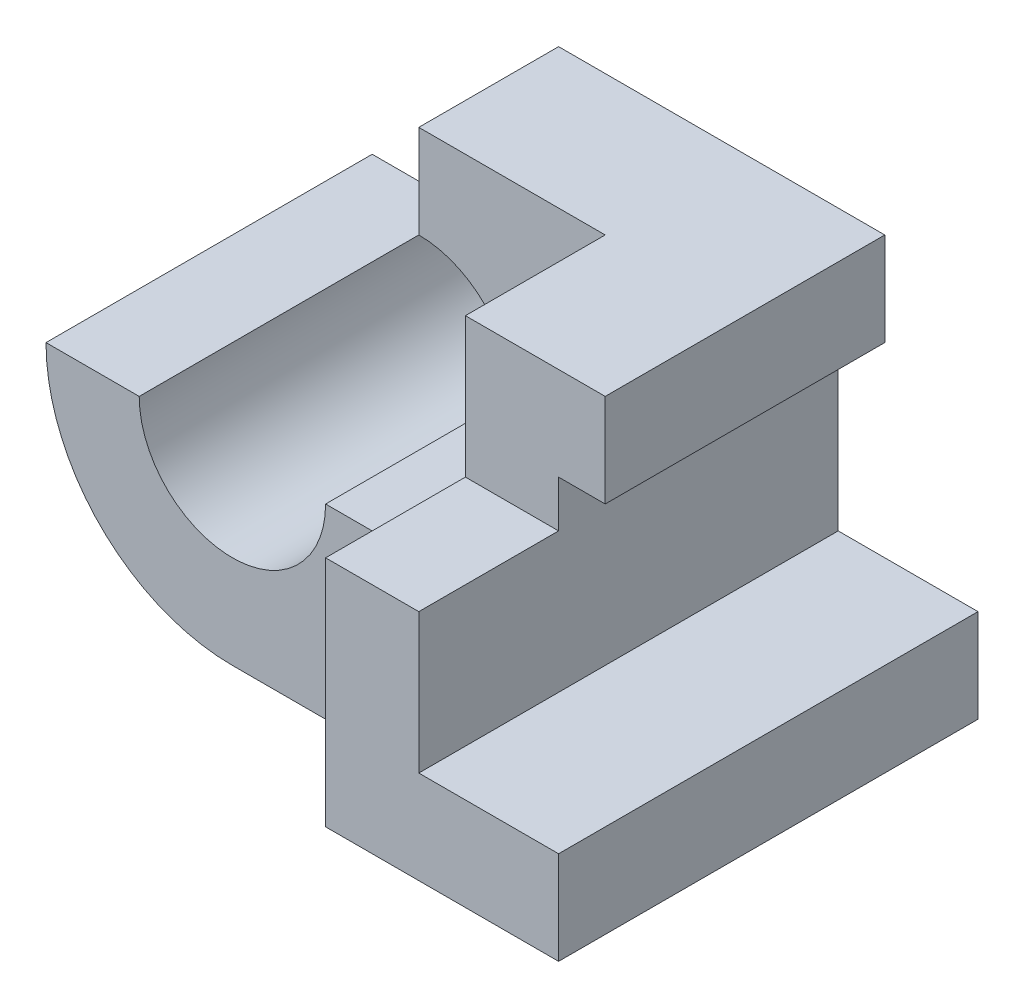
ISO-10303-21;
HEADER;
FILE_DESCRIPTION(('STEP AP214'),'2;1');
FILE_NAME('part.step','',(''),(''),'','','');
FILE_SCHEMA(('AUTOMOTIVE_DESIGN { 1 0 10303 214 1 1 1 1 }'));
ENDSEC;
DATA;
#1=APPLICATION_CONTEXT('core data for automotive mechanical design processes');
#2=APPLICATION_PROTOCOL_DEFINITION('international standard','automotive_design',2000,#1);
#3=PRODUCT_CONTEXT('',#1,'mechanical');
#4=PRODUCT('Part','Part','',(#3));
#5=PRODUCT_RELATED_PRODUCT_CATEGORY('part','',(#4));
#6=PRODUCT_DEFINITION_FORMATION('','',#4);
#7=PRODUCT_DEFINITION_CONTEXT('part definition',#1,'design');
#8=PRODUCT_DEFINITION('design','',#6,#7);
#9=PRODUCT_DEFINITION_SHAPE('','',#8);
#10=(LENGTH_UNIT() NAMED_UNIT(*) SI_UNIT(.MILLI.,.METRE.));
#11=(NAMED_UNIT(*) PLANE_ANGLE_UNIT() SI_UNIT($,.RADIAN.));
#12=(NAMED_UNIT(*) SI_UNIT($,.STERADIAN.) SOLID_ANGLE_UNIT());
#13=UNCERTAINTY_MEASURE_WITH_UNIT(LENGTH_MEASURE(1.E-05),#10,'distance_accuracy_value','');
#14=(GEOMETRIC_REPRESENTATION_CONTEXT(3) GLOBAL_UNCERTAINTY_ASSIGNED_CONTEXT((#13)) GLOBAL_UNIT_ASSIGNED_CONTEXT((#10,
#11,#12)) REPRESENTATION_CONTEXT('',''));
#15=CARTESIAN_POINT('',(0.,0.,0.));
#16=DIRECTION('',(0.,0.,1.));
#17=DIRECTION('',(1.,0.,0.));
#18=AXIS2_PLACEMENT_3D('',#15,#16,#17);
#19=CARTESIAN_POINT('',(0.,0.,0.));
#20=DIRECTION('',(0.,0.,1.));
#21=DIRECTION('',(1.,0.,0.));
#22=AXIS2_PLACEMENT_3D('',#19,#20,#21);
#23=PLANE('',#22);
#24=DIRECTION('',(1.,0.,0.));
#25=VECTOR('',#24,1.);
#26=CARTESIAN_POINT('',(0.,40.,0.));
#27=LINE('',#26,#25);
#28=CARTESIAN_POINT('',(0.,40.,0.));
#29=VERTEX_POINT('',#28);
#30=CARTESIAN_POINT('',(70.,40.,0.));
#31=VERTEX_POINT('',#30);
#32=EDGE_CURVE('E175',#29,#31,#27,.T.);
#33=ORIENTED_EDGE('',*,*,#32,.T.);
#34=DIRECTION('',(0.,-1.,0.));
#35=VECTOR('',#34,1.);
#36=CARTESIAN_POINT('',(70.,40.,0.));
#37=LINE('',#36,#35);
#38=CARTESIAN_POINT('',(70.,20.,0.));
#39=VERTEX_POINT('',#38);
#40=EDGE_CURVE('E159',#31,#39,#37,.T.);
#41=ORIENTED_EDGE('',*,*,#40,.T.);
#42=DIRECTION('',(-1.,0.,0.));
#43=VECTOR('',#42,1.);
#44=CARTESIAN_POINT('',(70.,20.,0.));
#45=LINE('',#44,#43);
#46=CARTESIAN_POINT('',(60.,20.,0.));
#47=VERTEX_POINT('',#46);
#48=EDGE_CURVE('E168',#39,#47,#45,.T.);
#49=ORIENTED_EDGE('',*,*,#48,.T.);
#50=DIRECTION('',(0.,1.,0.));
#51=VECTOR('',#50,1.);
#52=CARTESIAN_POINT('',(60.,10.,0.));
#53=LINE('',#52,#51);
#54=CARTESIAN_POINT('',(60.,-20.,0.));
#55=VERTEX_POINT('',#54);
#56=EDGE_CURVE('E50',#55,#47,#53,.T.);
#57=ORIENTED_EDGE('',*,*,#56,.F.);
#58=DIRECTION('',(1.,0.,0.));
#59=VECTOR('',#58,1.);
#60=CARTESIAN_POINT('',(70.,-20.,0.));
#61=LINE('',#60,#59);
#62=CARTESIAN_POINT('',(90.,-20.,0.));
#63=VERTEX_POINT('',#62);
#64=EDGE_CURVE('E58',#55,#63,#61,.T.);
#65=ORIENTED_EDGE('',*,*,#64,.T.);
#66=DIRECTION('',(0.,1.,0.));
#67=VECTOR('',#66,1.);
#68=CARTESIAN_POINT('',(90.,-20.,0.));
#69=LINE('',#68,#67);
#70=CARTESIAN_POINT('',(90.,-40.,0.));
#71=VERTEX_POINT('',#70);
#72=EDGE_CURVE('E188',#71,#63,#69,.T.);
#73=ORIENTED_EDGE('',*,*,#72,.F.);
#74=DIRECTION('',(-1.,0.,0.));
#75=VECTOR('',#74,1.);
#76=CARTESIAN_POINT('',(0.,-40.,0.));
#77=LINE('',#76,#75);
#78=CARTESIAN_POINT('',(-1.34760665507113E-13,-40.,0.));
#79=VERTEX_POINT('',#78);
#80=EDGE_CURVE('E271',#71,#79,#77,.T.);
#81=ORIENTED_EDGE('',*,*,#80,.T.);
#82=CARTESIAN_POINT('',(0.,0.,0.));
#83=DIRECTION('',(0.,0.,1.));
#84=DIRECTION('',(1.,0.,0.));
#85=AXIS2_PLACEMENT_3D('',#82,#83,#84);
#86=CIRCLE('',#85,40.);
#87=CARTESIAN_POINT('',(-40.,0.,0.));
#88=VERTEX_POINT('',#87);
#89=EDGE_CURVE('E263',#79,#88,#86,.F.);
#90=ORIENTED_EDGE('',*,*,#89,.T.);
#91=DIRECTION('',(1.,0.,0.));
#92=VECTOR('',#91,1.);
#93=CARTESIAN_POINT('',(0.,0.,0.));
#94=LINE('',#93,#92);
#95=CARTESIAN_POINT('',(-20.,0.,0.));
#96=VERTEX_POINT('',#95);
#97=EDGE_CURVE('E268',#88,#96,#94,.T.);
#98=ORIENTED_EDGE('',*,*,#97,.T.);
#99=CARTESIAN_POINT('',(0.,0.,0.));
#100=DIRECTION('',(0.,0.,1.));
#101=DIRECTION('',(1.,0.,0.));
#102=AXIS2_PLACEMENT_3D('',#99,#100,#101);
#103=CIRCLE('',#102,20.);
#104=CARTESIAN_POINT('',(0.,20.,0.));
#105=VERTEX_POINT('',#104);
#106=EDGE_CURVE('E278',#96,#105,#103,.T.);
#107=ORIENTED_EDGE('',*,*,#106,.T.);
#108=DIRECTION('',(0.,-1.,0.));
#109=VECTOR('',#108,1.);
#110=CARTESIAN_POINT('',(0.,0.,0.));
#111=LINE('',#110,#109);
#112=EDGE_CURVE('E275',#29,#105,#111,.T.);
#113=ORIENTED_EDGE('',*,*,#112,.F.);
#114=EDGE_LOOP('',(#33,#41,#49,#57,#65,#73,#81,#90,#98,#107,#113));
#115=FACE_BOUND('',#114,.T.);
#116=ADVANCED_FACE('F35',(#115),#23,.F.);
#117=CARTESIAN_POINT('',(70.,-20.,0.));
#118=DIRECTION('',(0.,-1.,0.));
#119=DIRECTION('',(1.,0.,0.));
#120=AXIS2_PLACEMENT_3D('',#117,#118,#119);
#121=PLANE('',#120);
#122=ORIENTED_EDGE('',*,*,#64,.F.);
#123=DIRECTION('',(0.,0.,-1.));
#124=VECTOR('',#123,1.);
#125=CARTESIAN_POINT('',(60.,-20.,90.));
#126=LINE('',#125,#124);
#127=CARTESIAN_POINT('',(60.,-20.,90.));
#128=VERTEX_POINT('',#127);
#129=EDGE_CURVE('E197',#128,#55,#126,.T.);
#130=ORIENTED_EDGE('',*,*,#129,.F.);
#131=DIRECTION('',(-1.,0.,0.));
#132=VECTOR('',#131,1.);
#133=CARTESIAN_POINT('',(50.,-20.,90.));
#134=LINE('',#133,#132);
#135=CARTESIAN_POINT('',(90.,-20.,90.));
#136=VERTEX_POINT('',#135);
#137=EDGE_CURVE('E206',#136,#128,#134,.T.);
#138=ORIENTED_EDGE('',*,*,#137,.F.);
#139=DIRECTION('',(0.,0.,1.));
#140=VECTOR('',#139,1.);
#141=CARTESIAN_POINT('',(90.,-20.,90.));
#142=LINE('',#141,#140);
#143=EDGE_CURVE('E191',#63,#136,#142,.T.);
#144=ORIENTED_EDGE('',*,*,#143,.F.);
#145=EDGE_LOOP('',(#122,#130,#138,#144));
#146=FACE_BOUND('',#145,.T.);
#147=ADVANCED_FACE('F302',(#146),#121,.F.);
#148=CARTESIAN_POINT('',(0.,40.,90.));
#149=DIRECTION('',(0.,1.,0.));
#150=DIRECTION('',(0.,0.,1.));
#151=AXIS2_PLACEMENT_3D('',#148,#149,#150);
#152=PLANE('',#151);
#153=DIRECTION('',(0.,0.,-1.));
#154=VECTOR('',#153,1.);
#155=CARTESIAN_POINT('',(70.,40.,0.));
#156=LINE('',#155,#154);
#157=CARTESIAN_POINT('',(70.,40.,60.));
#158=VERTEX_POINT('',#157);
#159=EDGE_CURVE('E203',#158,#31,#156,.T.);
#160=ORIENTED_EDGE('',*,*,#159,.T.);
#161=ORIENTED_EDGE('',*,*,#32,.F.);
#162=DIRECTION('',(0.,0.,-1.));
#163=VECTOR('',#162,1.);
#164=CARTESIAN_POINT('',(0.,40.,90.));
#165=LINE('',#164,#163);
#166=CARTESIAN_POINT('',(0.,40.,30.));
#167=VERTEX_POINT('',#166);
#168=EDGE_CURVE('E288',#167,#29,#165,.T.);
#169=ORIENTED_EDGE('',*,*,#168,.F.);
#170=DIRECTION('',(-1.,0.,0.));
#171=VECTOR('',#170,1.);
#172=CARTESIAN_POINT('',(0.,40.,30.));
#173=LINE('',#172,#171);
#174=CARTESIAN_POINT('',(40.,40.,30.));
#175=VERTEX_POINT('',#174);
#176=EDGE_CURVE('E228',#175,#167,#173,.T.);
#177=ORIENTED_EDGE('',*,*,#176,.F.);
#178=DIRECTION('',(0.,0.,1.));
#179=VECTOR('',#178,1.);
#180=CARTESIAN_POINT('',(40.,40.,30.));
#181=LINE('',#180,#179);
#182=CARTESIAN_POINT('',(40.,40.,60.));
#183=VERTEX_POINT('',#182);
#184=EDGE_CURVE('E235',#175,#183,#181,.T.);
#185=ORIENTED_EDGE('',*,*,#184,.T.);
#186=DIRECTION('',(1.,0.,0.));
#187=VECTOR('',#186,1.);
#188=CARTESIAN_POINT('',(30.,40.,60.));
#189=LINE('',#188,#187);
#190=EDGE_CURVE('E210',#183,#158,#189,.T.);
#191=ORIENTED_EDGE('',*,*,#190,.T.);
#192=EDGE_LOOP('',(#160,#161,#169,#177,#185,#191));
#193=FACE_BOUND('',#192,.T.);
#194=ADVANCED_FACE('F336',(#193),#152,.T.);
#195=CARTESIAN_POINT('',(0.,0.,90.));
#196=DIRECTION('',(0.,0.,-1.));
#197=DIRECTION('',(-1.,0.,0.));
#198=AXIS2_PLACEMENT_3D('',#195,#196,#197);
#199=CYLINDRICAL_SURFACE('',#198,40.);
#200=DIRECTION('',(0.,0.,-1.));
#201=VECTOR('',#200,1.);
#202=CARTESIAN_POINT('',(-1.34760665507113E-13,-40.,90.));
#203=LINE('',#202,#201);
#204=CARTESIAN_POINT('',(-1.31838984174237E-13,-40.,70.));
#205=VERTEX_POINT('',#204);
#206=EDGE_CURVE('E43',#205,#79,#203,.T.);
#207=ORIENTED_EDGE('',*,*,#206,.F.);
#208=CARTESIAN_POINT('',(0.,0.,70.));
#209=DIRECTION('',(0.,0.,1.));
#210=DIRECTION('',(1.,0.,0.));
#211=AXIS2_PLACEMENT_3D('',#208,#209,#210);
#212=CIRCLE('',#211,40.);
#213=CARTESIAN_POINT('',(-40.,0.,70.));
#214=VERTEX_POINT('',#213);
#215=EDGE_CURVE('E259',#205,#214,#212,.F.);
#216=ORIENTED_EDGE('',*,*,#215,.T.);
#217=DIRECTION('',(0.,0.,-1.));
#218=VECTOR('',#217,1.);
#219=CARTESIAN_POINT('',(-40.,0.,90.));
#220=LINE('',#219,#218);
#221=EDGE_CURVE('E267',#214,#88,#220,.T.);
#222=ORIENTED_EDGE('',*,*,#221,.T.);
#223=ORIENTED_EDGE('',*,*,#89,.F.);
#224=EDGE_LOOP('',(#207,#216,#222,#223));
#225=FACE_BOUND('',#224,.T.);
#226=ADVANCED_FACE('F37',(#225),#199,.T.);
#227=CARTESIAN_POINT('',(0.,-40.,90.));
#228=DIRECTION('',(0.,-1.,0.));
#229=DIRECTION('',(0.,0.,-1.));
#230=AXIS2_PLACEMENT_3D('',#227,#228,#229);
#231=PLANE('',#230);
#232=DIRECTION('',(-1.,0.,0.));
#233=VECTOR('',#232,1.);
#234=CARTESIAN_POINT('',(0.,-40.,90.));
#235=LINE('',#234,#233);
#236=CARTESIAN_POINT('',(90.,-40.,90.));
#237=VERTEX_POINT('',#236);
#238=CARTESIAN_POINT('',(40.,-40.,90.));
#239=VERTEX_POINT('',#238);
#240=EDGE_CURVE('E264',#237,#239,#235,.T.);
#241=ORIENTED_EDGE('',*,*,#240,.T.);
#242=DIRECTION('',(0.,0.,-1.));
#243=VECTOR('',#242,1.);
#244=CARTESIAN_POINT('',(40.,-40.,90.));
#245=LINE('',#244,#243);
#246=CARTESIAN_POINT('',(40.,-40.,70.));
#247=VERTEX_POINT('',#246);
#248=EDGE_CURVE('E238',#239,#247,#245,.T.);
#249=ORIENTED_EDGE('',*,*,#248,.T.);
#250=DIRECTION('',(-1.,0.,0.));
#251=VECTOR('',#250,1.);
#252=CARTESIAN_POINT('',(-40.,-40.,70.));
#253=LINE('',#252,#251);
#254=EDGE_CURVE('E245',#247,#205,#253,.T.);
#255=ORIENTED_EDGE('',*,*,#254,.T.);
#256=ORIENTED_EDGE('',*,*,#206,.T.);
#257=ORIENTED_EDGE('',*,*,#80,.F.);
#258=DIRECTION('',(0.,0.,-1.));
#259=VECTOR('',#258,1.);
#260=CARTESIAN_POINT('',(90.,-40.,90.));
#261=LINE('',#260,#259);
#262=EDGE_CURVE('E185',#237,#71,#261,.T.);
#263=ORIENTED_EDGE('',*,*,#262,.F.);
#264=EDGE_LOOP('',(#241,#249,#255,#256,#257,#263));
#265=FACE_BOUND('',#264,.T.);
#266=ADVANCED_FACE('F292',(#265),#231,.T.);
#267=CARTESIAN_POINT('',(0.,0.,90.));
#268=DIRECTION('',(1.,0.,0.));
#269=DIRECTION('',(0.,1.,0.));
#270=AXIS2_PLACEMENT_3D('',#267,#268,#269);
#271=PLANE('',#270);
#272=DIRECTION('',(0.,0.,-1.));
#273=VECTOR('',#272,1.);
#274=CARTESIAN_POINT('',(0.,20.,90.));
#275=LINE('',#274,#273);
#276=CARTESIAN_POINT('',(0.,20.,30.));
#277=VERTEX_POINT('',#276);
#278=EDGE_CURVE('E286',#277,#105,#275,.T.);
#279=ORIENTED_EDGE('',*,*,#278,.F.);
#280=DIRECTION('',(0.,-1.,0.));
#281=VECTOR('',#280,1.);
#282=CARTESIAN_POINT('',(0.,20.,30.));
#283=LINE('',#282,#281);
#284=EDGE_CURVE('E230',#167,#277,#283,.T.);
#285=ORIENTED_EDGE('',*,*,#284,.F.);
#286=ORIENTED_EDGE('',*,*,#168,.T.);
#287=ORIENTED_EDGE('',*,*,#112,.T.);
#288=EDGE_LOOP('',(#279,#285,#286,#287));
#289=FACE_BOUND('',#288,.T.);
#290=ADVANCED_FACE('F332',(#289),#271,.F.);
#291=CARTESIAN_POINT('',(0.,0.,90.));
#292=DIRECTION('',(0.,0.,-1.));
#293=DIRECTION('',(-1.,0.,0.));
#294=AXIS2_PLACEMENT_3D('',#291,#292,#293);
#295=CYLINDRICAL_SURFACE('',#294,20.);
#296=DIRECTION('',(0.,0.,1.));
#297=VECTOR('',#296,1.);
#298=CARTESIAN_POINT('',(20.,0.,30.));
#299=LINE('',#298,#297);
#300=CARTESIAN_POINT('',(20.,0.,30.));
#301=VERTEX_POINT('',#300);
#302=CARTESIAN_POINT('',(20.,0.,70.));
#303=VERTEX_POINT('',#302);
#304=EDGE_CURVE('E232',#301,#303,#299,.T.);
#305=ORIENTED_EDGE('',*,*,#304,.F.);
#306=CARTESIAN_POINT('',(0.,0.,30.));
#307=DIRECTION('',(0.,0.,-1.));
#308=DIRECTION('',(-1.,0.,0.));
#309=AXIS2_PLACEMENT_3D('',#306,#307,#308);
#310=CIRCLE('',#309,20.);
#311=EDGE_CURVE('E220',#277,#301,#310,.T.);
#312=ORIENTED_EDGE('',*,*,#311,.F.);
#313=ORIENTED_EDGE('',*,*,#278,.T.);
#314=ORIENTED_EDGE('',*,*,#106,.F.);
#315=DIRECTION('',(0.,0.,-1.));
#316=VECTOR('',#315,1.);
#317=CARTESIAN_POINT('',(-20.,0.,90.));
#318=LINE('',#317,#316);
#319=CARTESIAN_POINT('',(-20.,0.,70.));
#320=VERTEX_POINT('',#319);
#321=EDGE_CURVE('E284',#320,#96,#318,.T.);
#322=ORIENTED_EDGE('',*,*,#321,.F.);
#323=CARTESIAN_POINT('',(0.,0.,70.));
#324=DIRECTION('',(0.,0.,1.));
#325=DIRECTION('',(1.,0.,0.));
#326=AXIS2_PLACEMENT_3D('',#323,#324,#325);
#327=CIRCLE('',#326,20.);
#328=EDGE_CURVE('E256',#320,#303,#327,.T.);
#329=ORIENTED_EDGE('',*,*,#328,.T.);
#330=EDGE_LOOP('',(#305,#312,#313,#314,#322,#329));
#331=FACE_BOUND('',#330,.T.);
#332=ADVANCED_FACE('F327',(#331),#295,.F.);
#333=CARTESIAN_POINT('',(0.,0.,90.));
#334=DIRECTION('',(0.,1.,0.));
#335=DIRECTION('',(0.,0.,1.));
#336=AXIS2_PLACEMENT_3D('',#333,#334,#335);
#337=PLANE('',#336);
#338=ORIENTED_EDGE('',*,*,#221,.F.);
#339=DIRECTION('',(1.,0.,0.));
#340=VECTOR('',#339,1.);
#341=CARTESIAN_POINT('',(0.,0.,70.));
#342=LINE('',#341,#340);
#343=EDGE_CURVE('E253',#214,#320,#342,.T.);
#344=ORIENTED_EDGE('',*,*,#343,.T.);
#345=ORIENTED_EDGE('',*,*,#321,.T.);
#346=ORIENTED_EDGE('',*,*,#97,.F.);
#347=EDGE_LOOP('',(#338,#344,#345,#346));
#348=FACE_BOUND('',#347,.T.);
#349=ADVANCED_FACE('F322',(#348),#337,.T.);
#350=CARTESIAN_POINT('',(0.,0.,90.));
#351=DIRECTION('',(0.,0.,1.));
#352=DIRECTION('',(1.,0.,0.));
#353=AXIS2_PLACEMENT_3D('',#350,#351,#352);
#354=PLANE('',#353);
#355=ORIENTED_EDGE('',*,*,#137,.T.);
#356=DIRECTION('',(0.,-1.,0.));
#357=VECTOR('',#356,1.);
#358=CARTESIAN_POINT('',(60.,10.,90.));
#359=LINE('',#358,#357);
#360=CARTESIAN_POINT('',(60.,10.,90.));
#361=VERTEX_POINT('',#360);
#362=EDGE_CURVE('E194',#361,#128,#359,.T.);
#363=ORIENTED_EDGE('',*,*,#362,.F.);
#364=DIRECTION('',(1.,0.,0.));
#365=VECTOR('',#364,1.);
#366=CARTESIAN_POINT('',(40.,10.,90.));
#367=LINE('',#366,#365);
#368=CARTESIAN_POINT('',(40.,10.,90.));
#369=VERTEX_POINT('',#368);
#370=EDGE_CURVE('E217',#369,#361,#367,.T.);
#371=ORIENTED_EDGE('',*,*,#370,.F.);
#372=DIRECTION('',(0.,-1.,0.));
#373=VECTOR('',#372,1.);
#374=CARTESIAN_POINT('',(40.,50.,90.));
#375=LINE('',#374,#373);
#376=EDGE_CURVE('E250',#369,#239,#375,.T.);
#377=ORIENTED_EDGE('',*,*,#376,.T.);
#378=ORIENTED_EDGE('',*,*,#240,.F.);
#379=DIRECTION('',(0.,-1.,0.));
#380=VECTOR('',#379,1.);
#381=CARTESIAN_POINT('',(90.,-20.,90.));
#382=LINE('',#381,#380);
#383=EDGE_CURVE('E181',#136,#237,#382,.T.);
#384=ORIENTED_EDGE('',*,*,#383,.F.);
#385=EDGE_LOOP('',(#355,#363,#371,#377,#378,#384));
#386=FACE_BOUND('',#385,.T.);
#387=ADVANCED_FACE('F305',(#386),#354,.T.);
#388=CARTESIAN_POINT('',(40.,50.,90.));
#389=DIRECTION('',(-1.,0.,0.));
#390=DIRECTION('',(0.,0.,1.));
#391=AXIS2_PLACEMENT_3D('',#388,#389,#390);
#392=PLANE('',#391);
#393=DIRECTION('',(0.,-1.,0.));
#394=VECTOR('',#393,1.);
#395=CARTESIAN_POINT('',(40.,50.,60.));
#396=LINE('',#395,#394);
#397=CARTESIAN_POINT('',(40.,10.,60.));
#398=VERTEX_POINT('',#397);
#399=EDGE_CURVE('E11',#183,#398,#396,.T.);
#400=ORIENTED_EDGE('',*,*,#399,.F.);
#401=ORIENTED_EDGE('',*,*,#184,.F.);
#402=DIRECTION('',(0.,1.,0.));
#403=VECTOR('',#402,1.);
#404=CARTESIAN_POINT('',(40.,40.,30.));
#405=LINE('',#404,#403);
#406=CARTESIAN_POINT('',(40.,0.,30.));
#407=VERTEX_POINT('',#406);
#408=EDGE_CURVE('E226',#407,#175,#405,.T.);
#409=ORIENTED_EDGE('',*,*,#408,.F.);
#410=DIRECTION('',(0.,0.,1.));
#411=VECTOR('',#410,1.);
#412=CARTESIAN_POINT('',(40.,0.,30.));
#413=LINE('',#412,#411);
#414=CARTESIAN_POINT('',(40.,0.,70.));
#415=VERTEX_POINT('',#414);
#416=EDGE_CURVE('E239',#407,#415,#413,.T.);
#417=ORIENTED_EDGE('',*,*,#416,.T.);
#418=DIRECTION('',(0.,-1.,0.));
#419=VECTOR('',#418,1.);
#420=CARTESIAN_POINT('',(40.,50.,70.));
#421=LINE('',#420,#419);
#422=EDGE_CURVE('E248',#415,#247,#421,.T.);
#423=ORIENTED_EDGE('',*,*,#422,.T.);
#424=ORIENTED_EDGE('',*,*,#248,.F.);
#425=ORIENTED_EDGE('',*,*,#376,.F.);
#426=DIRECTION('',(0.,0.,-1.));
#427=VECTOR('',#426,1.);
#428=CARTESIAN_POINT('',(40.,10.,0.));
#429=LINE('',#428,#427);
#430=EDGE_CURVE('E213',#369,#398,#429,.T.);
#431=ORIENTED_EDGE('',*,*,#430,.T.);
#432=EDGE_LOOP('',(#400,#401,#409,#417,#423,#424,#425,#431));
#433=FACE_BOUND('',#432,.T.);
#434=ADVANCED_FACE('F316',(#433),#392,.T.);
#435=CARTESIAN_POINT('',(-40.,50.,70.));
#436=DIRECTION('',(0.,0.,1.));
#437=DIRECTION('',(1.,0.,0.));
#438=AXIS2_PLACEMENT_3D('',#435,#436,#437);
#439=PLANE('',#438);
#440=DIRECTION('',(1.,0.,0.));
#441=VECTOR('',#440,1.);
#442=CARTESIAN_POINT('',(20.,0.,70.));
#443=LINE('',#442,#441);
#444=EDGE_CURVE('E219',#303,#415,#443,.T.);
#445=ORIENTED_EDGE('',*,*,#444,.F.);
#446=ORIENTED_EDGE('',*,*,#328,.F.);
#447=ORIENTED_EDGE('',*,*,#343,.F.);
#448=ORIENTED_EDGE('',*,*,#215,.F.);
#449=ORIENTED_EDGE('',*,*,#254,.F.);
#450=ORIENTED_EDGE('',*,*,#422,.F.);
#451=EDGE_LOOP('',(#445,#446,#447,#448,#449,#450));
#452=FACE_BOUND('',#451,.T.);
#453=ADVANCED_FACE('F320',(#452),#439,.T.);
#454=CARTESIAN_POINT('',(20.,0.,30.));
#455=DIRECTION('',(0.,-1.,0.));
#456=DIRECTION('',(1.,0.,0.));
#457=AXIS2_PLACEMENT_3D('',#454,#455,#456);
#458=PLANE('',#457);
#459=ORIENTED_EDGE('',*,*,#444,.T.);
#460=ORIENTED_EDGE('',*,*,#416,.F.);
#461=DIRECTION('',(1.,0.,0.));
#462=VECTOR('',#461,1.);
#463=CARTESIAN_POINT('',(20.,0.,30.));
#464=LINE('',#463,#462);
#465=EDGE_CURVE('E223',#301,#407,#464,.T.);
#466=ORIENTED_EDGE('',*,*,#465,.F.);
#467=ORIENTED_EDGE('',*,*,#304,.T.);
#468=EDGE_LOOP('',(#459,#460,#466,#467));
#469=FACE_BOUND('',#468,.T.);
#470=ADVANCED_FACE('F342',(#469),#458,.F.);
#471=CARTESIAN_POINT('',(0.,0.,30.));
#472=DIRECTION('',(0.,0.,-1.));
#473=DIRECTION('',(-1.,0.,0.));
#474=AXIS2_PLACEMENT_3D('',#471,#472,#473);
#475=PLANE('',#474);
#476=ORIENTED_EDGE('',*,*,#311,.T.);
#477=ORIENTED_EDGE('',*,*,#465,.T.);
#478=ORIENTED_EDGE('',*,*,#408,.T.);
#479=ORIENTED_EDGE('',*,*,#176,.T.);
#480=ORIENTED_EDGE('',*,*,#284,.T.);
#481=EDGE_LOOP('',(#476,#477,#478,#479,#480));
#482=FACE_BOUND('',#481,.T.);
#483=ADVANCED_FACE('F343',(#482),#475,.F.);
#484=CARTESIAN_POINT('',(40.,10.,0.));
#485=DIRECTION('',(0.,-1.,0.));
#486=DIRECTION('',(0.,0.,-1.));
#487=AXIS2_PLACEMENT_3D('',#484,#485,#486);
#488=PLANE('',#487);
#489=ORIENTED_EDGE('',*,*,#370,.T.);
#490=DIRECTION('',(0.,0.,1.));
#491=VECTOR('',#490,1.);
#492=CARTESIAN_POINT('',(60.,10.,90.));
#493=LINE('',#492,#491);
#494=CARTESIAN_POINT('',(60.,10.,60.));
#495=VERTEX_POINT('',#494);
#496=EDGE_CURVE('E200',#495,#361,#493,.T.);
#497=ORIENTED_EDGE('',*,*,#496,.F.);
#498=DIRECTION('',(1.,0.,0.));
#499=VECTOR('',#498,1.);
#500=CARTESIAN_POINT('',(30.,10.,60.));
#501=LINE('',#500,#499);
#502=EDGE_CURVE('E209',#398,#495,#501,.T.);
#503=ORIENTED_EDGE('',*,*,#502,.F.);
#504=ORIENTED_EDGE('',*,*,#430,.F.);
#505=EDGE_LOOP('',(#489,#497,#503,#504));
#506=FACE_BOUND('',#505,.T.);
#507=ADVANCED_FACE('F312',(#506),#488,.F.);
#508=CARTESIAN_POINT('',(30.,40.,60.));
#509=DIRECTION('',(0.,0.,-1.));
#510=DIRECTION('',(0.,1.,0.));
#511=AXIS2_PLACEMENT_3D('',#508,#509,#510);
#512=PLANE('',#511);
#513=ORIENTED_EDGE('',*,*,#502,.T.);
#514=DIRECTION('',(0.,-1.,0.));
#515=VECTOR('',#514,1.);
#516=CARTESIAN_POINT('',(60.,10.,60.));
#517=LINE('',#516,#515);
#518=CARTESIAN_POINT('',(60.,20.,60.));
#519=VERTEX_POINT('',#518);
#520=EDGE_CURVE('E165',#519,#495,#517,.T.);
#521=ORIENTED_EDGE('',*,*,#520,.F.);
#522=DIRECTION('',(-1.,0.,0.));
#523=VECTOR('',#522,1.);
#524=CARTESIAN_POINT('',(70.,20.,60.));
#525=LINE('',#524,#523);
#526=CARTESIAN_POINT('',(70.,20.,60.));
#527=VERTEX_POINT('',#526);
#528=EDGE_CURVE('E171',#527,#519,#525,.T.);
#529=ORIENTED_EDGE('',*,*,#528,.F.);
#530=DIRECTION('',(0.,1.,0.));
#531=VECTOR('',#530,1.);
#532=CARTESIAN_POINT('',(70.,10.,60.));
#533=LINE('',#532,#531);
#534=EDGE_CURVE('E160',#527,#158,#533,.T.);
#535=ORIENTED_EDGE('',*,*,#534,.T.);
#536=ORIENTED_EDGE('',*,*,#190,.F.);
#537=ORIENTED_EDGE('',*,*,#399,.T.);
#538=EDGE_LOOP('',(#513,#521,#529,#535,#536,#537));
#539=FACE_BOUND('',#538,.T.);
#540=ADVANCED_FACE('F339',(#539),#512,.F.);
#541=CARTESIAN_POINT('',(70.,10.,0.));
#542=DIRECTION('',(1.,0.,0.));
#543=DIRECTION('',(0.,0.,-1.));
#544=AXIS2_PLACEMENT_3D('',#541,#542,#543);
#545=PLANE('',#544);
#546=DIRECTION('',(0.,0.,1.));
#547=VECTOR('',#546,1.);
#548=CARTESIAN_POINT('',(70.,20.,30.));
#549=LINE('',#548,#547);
#550=EDGE_CURVE('E154',#39,#527,#549,.T.);
#551=ORIENTED_EDGE('',*,*,#550,.F.);
#552=ORIENTED_EDGE('',*,*,#40,.F.);
#553=ORIENTED_EDGE('',*,*,#159,.F.);
#554=ORIENTED_EDGE('',*,*,#534,.F.);
#555=EDGE_LOOP('',(#551,#552,#553,#554));
#556=FACE_BOUND('',#555,.T.);
#557=ADVANCED_FACE('F156',(#556),#545,.T.);
#558=CARTESIAN_POINT('',(60.,0.,0.));
#559=DIRECTION('',(1.,0.,0.));
#560=DIRECTION('',(0.,0.,-1.));
#561=AXIS2_PLACEMENT_3D('',#558,#559,#560);
#562=PLANE('',#561);
#563=ORIENTED_EDGE('',*,*,#56,.T.);
#564=DIRECTION('',(0.,0.,1.));
#565=VECTOR('',#564,1.);
#566=CARTESIAN_POINT('',(60.,20.,30.));
#567=LINE('',#566,#565);
#568=EDGE_CURVE('E164',#47,#519,#567,.T.);
#569=ORIENTED_EDGE('',*,*,#568,.T.);
#570=ORIENTED_EDGE('',*,*,#520,.T.);
#571=ORIENTED_EDGE('',*,*,#496,.T.);
#572=ORIENTED_EDGE('',*,*,#362,.T.);
#573=ORIENTED_EDGE('',*,*,#129,.T.);
#574=EDGE_LOOP('',(#563,#569,#570,#571,#572,#573));
#575=FACE_BOUND('',#574,.T.);
#576=ADVANCED_FACE('F307',(#575),#562,.T.);
#577=CARTESIAN_POINT('',(90.,0.,0.));
#578=DIRECTION('',(1.,0.,0.));
#579=DIRECTION('',(0.,0.,-1.));
#580=AXIS2_PLACEMENT_3D('',#577,#578,#579);
#581=PLANE('',#580);
#582=ORIENTED_EDGE('',*,*,#383,.T.);
#583=ORIENTED_EDGE('',*,*,#262,.T.);
#584=ORIENTED_EDGE('',*,*,#72,.T.);
#585=ORIENTED_EDGE('',*,*,#143,.T.);
#586=EDGE_LOOP('',(#582,#583,#584,#585));
#587=FACE_BOUND('',#586,.T.);
#588=ADVANCED_FACE('F300',(#587),#581,.T.);
#589=CARTESIAN_POINT('',(70.,20.,30.));
#590=DIRECTION('',(0.,1.,0.));
#591=DIRECTION('',(0.,0.,1.));
#592=AXIS2_PLACEMENT_3D('',#589,#590,#591);
#593=PLANE('',#592);
#594=ORIENTED_EDGE('',*,*,#568,.F.);
#595=ORIENTED_EDGE('',*,*,#48,.F.);
#596=ORIENTED_EDGE('',*,*,#550,.T.);
#597=ORIENTED_EDGE('',*,*,#528,.T.);
#598=EDGE_LOOP('',(#594,#595,#596,#597));
#599=FACE_BOUND('',#598,.T.);
#600=ADVANCED_FACE('F169',(#599),#593,.F.);
#601=CLOSED_SHELL('',(#116,#147,#194,#226,#266,#290,#332,#349,#387,#434,#453,#470,#483,#507,
#540,#557,#576,#588,#600));
#602=MANIFOLD_SOLID_BREP('B2',#601);
#603=ADVANCED_BREP_SHAPE_REPRESENTATION('',(#18,#602),#14);
#604=SHAPE_DEFINITION_REPRESENTATION(#9,#603);
ENDSEC;
END-ISO-10303-21;
